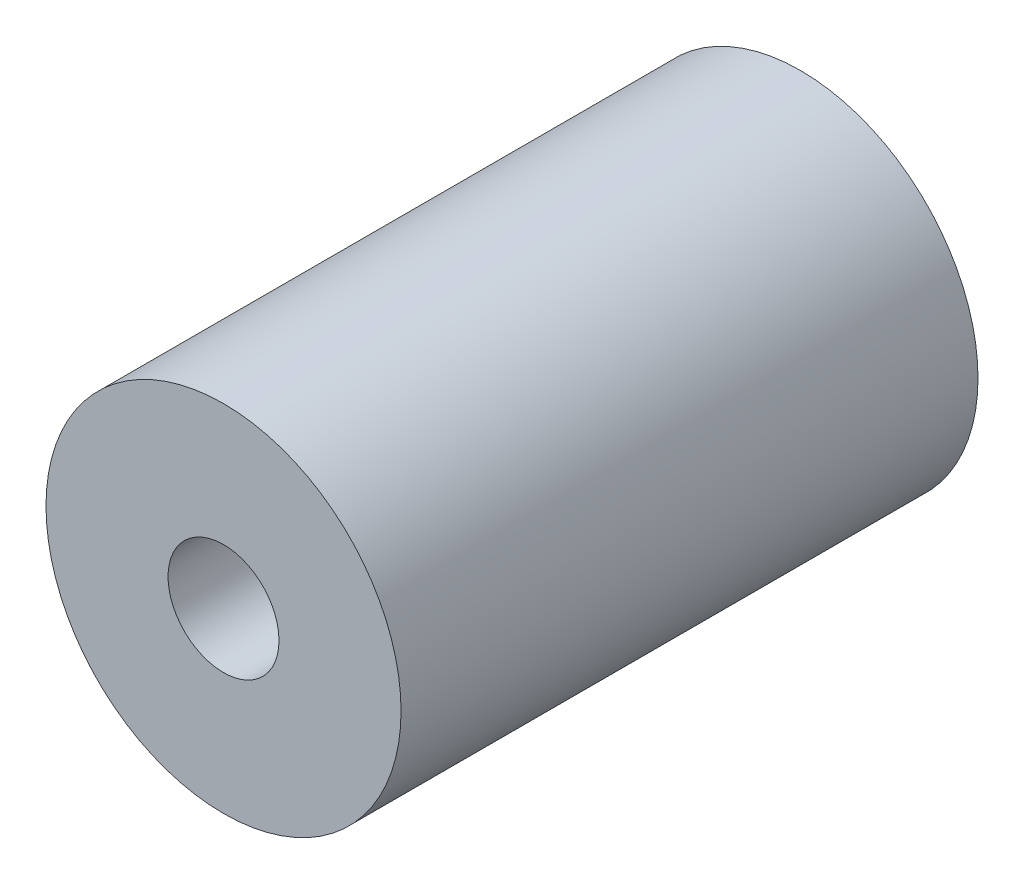
ISO-10303-21;
HEADER;
FILE_DESCRIPTION(('STEP AP214'),'2;1');
FILE_NAME('part.step','',(''),(''),'','','');
FILE_SCHEMA(('AUTOMOTIVE_DESIGN { 1 0 10303 214 1 1 1 1 }'));
ENDSEC;
DATA;
#1=APPLICATION_CONTEXT('core data for automotive mechanical design processes');
#2=APPLICATION_PROTOCOL_DEFINITION('international standard','automotive_design',2000,#1);
#3=PRODUCT_CONTEXT('',#1,'mechanical');
#4=PRODUCT('Part','Part','',(#3));
#5=PRODUCT_RELATED_PRODUCT_CATEGORY('part','',(#4));
#6=PRODUCT_DEFINITION_FORMATION('','',#4);
#7=PRODUCT_DEFINITION_CONTEXT('part definition',#1,'design');
#8=PRODUCT_DEFINITION('design','',#6,#7);
#9=PRODUCT_DEFINITION_SHAPE('','',#8);
#10=(LENGTH_UNIT() NAMED_UNIT(*) SI_UNIT(.MILLI.,.METRE.));
#11=(NAMED_UNIT(*) PLANE_ANGLE_UNIT() SI_UNIT($,.RADIAN.));
#12=(NAMED_UNIT(*) SI_UNIT($,.STERADIAN.) SOLID_ANGLE_UNIT());
#13=UNCERTAINTY_MEASURE_WITH_UNIT(LENGTH_MEASURE(1.E-05),#10,'distance_accuracy_value','');
#14=(GEOMETRIC_REPRESENTATION_CONTEXT(3) GLOBAL_UNCERTAINTY_ASSIGNED_CONTEXT((#13)) GLOBAL_UNIT_ASSIGNED_CONTEXT((#10,
#11,#12)) REPRESENTATION_CONTEXT('',''));
#15=CARTESIAN_POINT('',(0.,0.,0.));
#16=DIRECTION('',(0.,0.,1.));
#17=DIRECTION('',(1.,0.,0.));
#18=AXIS2_PLACEMENT_3D('',#15,#16,#17);
#19=CARTESIAN_POINT('',(0.,0.,26.));
#20=DIRECTION('',(0.,0.,1.));
#21=DIRECTION('',(1.,0.,0.));
#22=AXIS2_PLACEMENT_3D('',#19,#20,#21);
#23=PLANE('',#22);
#24=CARTESIAN_POINT('',(0.,0.,26.));
#25=DIRECTION('',(0.,0.,1.));
#26=DIRECTION('',(1.,0.,0.));
#27=AXIS2_PLACEMENT_3D('',#24,#25,#26);
#28=CIRCLE('',#27,8.);
#29=CARTESIAN_POINT('',(8.,0.,26.));
#30=VERTEX_POINT('',#29);
#31=EDGE_CURVE('E10',#30,#30,#28,.T.);
#32=ORIENTED_EDGE('',*,*,#31,.T.);
#33=EDGE_LOOP('',(#32));
#34=FACE_BOUND('',#33,.T.);
#35=CARTESIAN_POINT('',(0.,0.,26.));
#36=DIRECTION('',(0.,0.,1.));
#37=DIRECTION('',(1.,0.,0.));
#38=AXIS2_PLACEMENT_3D('',#35,#36,#37);
#39=CIRCLE('',#38,2.5);
#40=CARTESIAN_POINT('',(2.5,0.,26.));
#41=VERTEX_POINT('',#40);
#42=EDGE_CURVE('E43',#41,#41,#39,.T.);
#43=ORIENTED_EDGE('',*,*,#42,.F.);
#44=EDGE_LOOP('',(#43));
#45=FACE_BOUND('',#44,.T.);
#46=ADVANCED_FACE('F32',(#34,#45),#23,.T.);
#47=CARTESIAN_POINT('',(0.,0.,0.));
#48=DIRECTION('',(0.,0.,1.));
#49=DIRECTION('',(1.,0.,0.));
#50=AXIS2_PLACEMENT_3D('',#47,#48,#49);
#51=PLANE('',#50);
#52=CARTESIAN_POINT('',(0.,0.,0.));
#53=DIRECTION('',(0.,0.,1.));
#54=DIRECTION('',(1.,0.,0.));
#55=AXIS2_PLACEMENT_3D('',#52,#53,#54);
#56=CIRCLE('',#55,8.);
#57=CARTESIAN_POINT('',(8.,0.,0.));
#58=VERTEX_POINT('',#57);
#59=EDGE_CURVE('E36',#58,#58,#56,.T.);
#60=ORIENTED_EDGE('',*,*,#59,.F.);
#61=EDGE_LOOP('',(#60));
#62=FACE_BOUND('',#61,.T.);
#63=CARTESIAN_POINT('',(0.,0.,0.));
#64=DIRECTION('',(0.,0.,1.));
#65=DIRECTION('',(1.,0.,0.));
#66=AXIS2_PLACEMENT_3D('',#63,#64,#65);
#67=CIRCLE('',#66,2.5);
#68=CARTESIAN_POINT('',(2.5,0.,0.));
#69=VERTEX_POINT('',#68);
#70=EDGE_CURVE('E45',#69,#69,#67,.T.);
#71=ORIENTED_EDGE('',*,*,#70,.T.);
#72=EDGE_LOOP('',(#71));
#73=FACE_BOUND('',#72,.T.);
#74=ADVANCED_FACE('F55',(#62,#73),#51,.F.);
#75=CARTESIAN_POINT('',(0.,0.,26.));
#76=DIRECTION('',(0.,0.,-1.));
#77=DIRECTION('',(-1.,0.,0.));
#78=AXIS2_PLACEMENT_3D('',#75,#76,#77);
#79=CYLINDRICAL_SURFACE('',#78,8.);
#80=ORIENTED_EDGE('',*,*,#31,.F.);
#81=EDGE_LOOP('',(#80));
#82=FACE_BOUND('',#81,.T.);
#83=ORIENTED_EDGE('',*,*,#59,.T.);
#84=EDGE_LOOP('',(#83));
#85=FACE_BOUND('',#84,.T.);
#86=ADVANCED_FACE('F34',(#82,#85),#79,.T.);
#87=CARTESIAN_POINT('',(0.,0.,26.));
#88=DIRECTION('',(0.,0.,-1.));
#89=DIRECTION('',(-1.,0.,0.));
#90=AXIS2_PLACEMENT_3D('',#87,#88,#89);
#91=CYLINDRICAL_SURFACE('',#90,2.5);
#92=ORIENTED_EDGE('',*,*,#42,.T.);
#93=EDGE_LOOP('',(#92));
#94=FACE_BOUND('',#93,.T.);
#95=ORIENTED_EDGE('',*,*,#70,.F.);
#96=EDGE_LOOP('',(#95));
#97=FACE_BOUND('',#96,.T.);
#98=ADVANCED_FACE('F51',(#94,#97),#91,.F.);
#99=CLOSED_SHELL('',(#46,#74,#86,#98));
#100=MANIFOLD_SOLID_BREP('B2',#99);
#101=ADVANCED_BREP_SHAPE_REPRESENTATION('',(#18,#100),#14);
#102=SHAPE_DEFINITION_REPRESENTATION(#9,#101);
ENDSEC;
END-ISO-10303-21;
